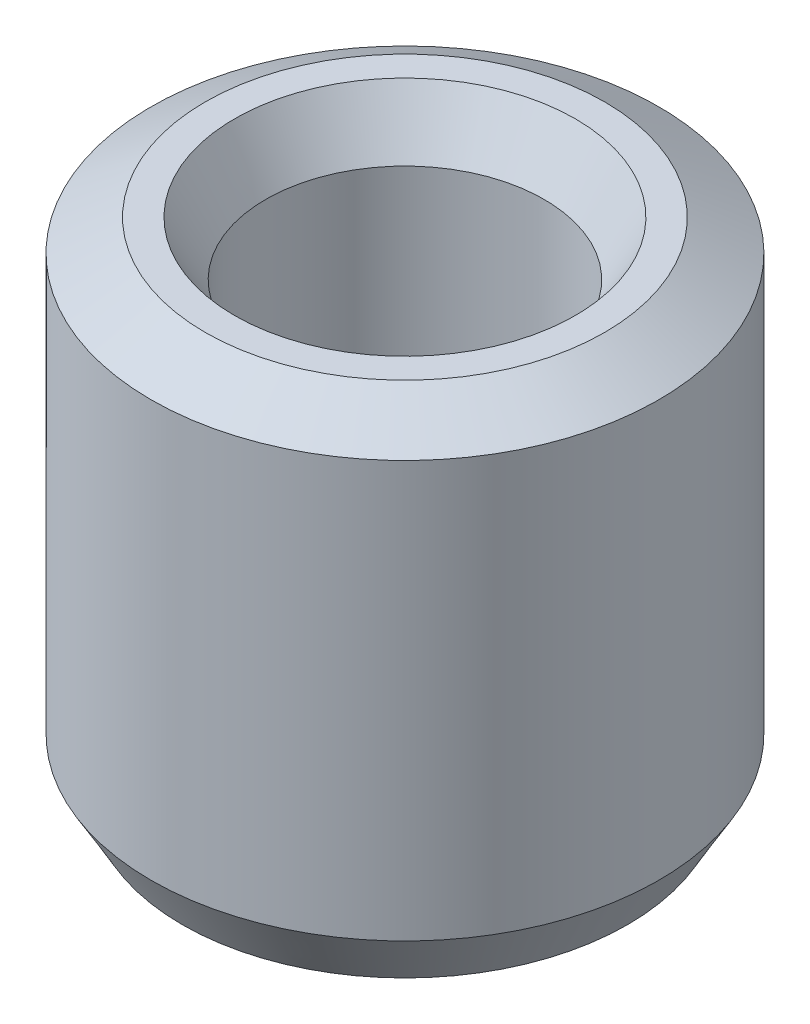
ISO-10303-21;
HEADER;
FILE_DESCRIPTION(('STEP AP214'),'2;1');
FILE_NAME('part.step','',(''),(''),'','','');
FILE_SCHEMA(('AUTOMOTIVE_DESIGN { 1 0 10303 214 1 1 1 1 }'));
ENDSEC;
DATA;
#1=APPLICATION_CONTEXT('core data for automotive mechanical design processes');
#2=APPLICATION_PROTOCOL_DEFINITION('international standard','automotive_design',2000,#1);
#3=PRODUCT_CONTEXT('',#1,'mechanical');
#4=PRODUCT('Part','Part','',(#3));
#5=PRODUCT_RELATED_PRODUCT_CATEGORY('part','',(#4));
#6=PRODUCT_DEFINITION_FORMATION('','',#4);
#7=PRODUCT_DEFINITION_CONTEXT('part definition',#1,'design');
#8=PRODUCT_DEFINITION('design','',#6,#7);
#9=PRODUCT_DEFINITION_SHAPE('','',#8);
#10=(LENGTH_UNIT() NAMED_UNIT(*) SI_UNIT(.MILLI.,.METRE.));
#11=(NAMED_UNIT(*) PLANE_ANGLE_UNIT() SI_UNIT($,.RADIAN.));
#12=(NAMED_UNIT(*) SI_UNIT($,.STERADIAN.) SOLID_ANGLE_UNIT());
#13=UNCERTAINTY_MEASURE_WITH_UNIT(LENGTH_MEASURE(1.E-05),#10,'distance_accuracy_value','');
#14=(GEOMETRIC_REPRESENTATION_CONTEXT(3) GLOBAL_UNCERTAINTY_ASSIGNED_CONTEXT((#13)) GLOBAL_UNIT_ASSIGNED_CONTEXT((#10,
#11,#12)) REPRESENTATION_CONTEXT('',''));
#15=CARTESIAN_POINT('',(0.,0.,0.));
#16=DIRECTION('',(0.,0.,1.));
#17=DIRECTION('',(1.,0.,0.));
#18=AXIS2_PLACEMENT_3D('',#15,#16,#17);
#19=CARTESIAN_POINT('',(0.,24.6970537670291,0.));
#20=DIRECTION('',(0.,-1.,0.));
#21=DIRECTION('',(0.,0.,-1.));
#22=AXIS2_PLACEMENT_3D('',#19,#20,#21);
#23=CYLINDRICAL_SURFACE('',#22,12.5);
#24=CARTESIAN_POINT('',(0.,2.66538334737681,0.));
#25=DIRECTION('',(0.,1.,0.));
#26=DIRECTION('',(0.,0.,1.));
#27=AXIS2_PLACEMENT_3D('',#24,#25,#26);
#28=CIRCLE('',#27,12.5);
#29=CARTESIAN_POINT('',(0.,2.66538334737681,12.5));
#30=VERTEX_POINT('',#29);
#31=EDGE_CURVE('E10',#30,#30,#28,.T.);
#32=ORIENTED_EDGE('',*,*,#31,.T.);
#33=EDGE_LOOP('',(#32));
#34=FACE_BOUND('',#33,.T.);
#35=CARTESIAN_POINT('',(0.,23.1581939739276,0.));
#36=DIRECTION('',(0.,1.,0.));
#37=DIRECTION('',(0.,0.,1.));
#38=AXIS2_PLACEMENT_3D('',#35,#36,#37);
#39=CIRCLE('',#38,12.5);
#40=CARTESIAN_POINT('',(0.,23.1581939739276,12.5));
#41=VERTEX_POINT('',#40);
#42=EDGE_CURVE('E50',#41,#41,#39,.F.);
#43=ORIENTED_EDGE('',*,*,#42,.T.);
#44=EDGE_LOOP('',(#43));
#45=FACE_BOUND('',#44,.T.);
#46=ADVANCED_FACE('F39',(#34,#45),#23,.T.);
#47=CARTESIAN_POINT('',(0.,24.6970537670291,0.));
#48=DIRECTION('',(0.,1.,0.));
#49=DIRECTION('',(0.,0.,1.));
#50=AXIS2_PLACEMENT_3D('',#47,#48,#49);
#51=PLANE('',#50);
#52=CARTESIAN_POINT('',(0.,24.6970537670291,0.));
#53=DIRECTION('',(0.,1.,0.));
#54=DIRECTION('',(0.,0.,1.));
#55=AXIS2_PLACEMENT_3D('',#52,#53,#54);
#56=CIRCLE('',#55,8.3917706725612);
#57=CARTESIAN_POINT('',(0.,24.6970537670291,8.3917706725612));
#58=VERTEX_POINT('',#57);
#59=EDGE_CURVE('E58',#58,#58,#56,.F.);
#60=ORIENTED_EDGE('',*,*,#59,.T.);
#61=EDGE_LOOP('',(#60));
#62=FACE_BOUND('',#61,.T.);
#63=CARTESIAN_POINT('',(0.,24.6970537670291,0.));
#64=DIRECTION('',(0.,1.,0.));
#65=DIRECTION('',(0.,0.,1.));
#66=AXIS2_PLACEMENT_3D('',#63,#64,#65);
#67=CIRCLE('',#66,9.8346166526232);
#68=CARTESIAN_POINT('',(0.,24.6970537670291,9.8346166526232));
#69=VERTEX_POINT('',#68);
#70=EDGE_CURVE('E61',#69,#69,#67,.T.);
#71=ORIENTED_EDGE('',*,*,#70,.T.);
#72=EDGE_LOOP('',(#71));
#73=FACE_BOUND('',#72,.T.);
#74=ADVANCED_FACE('F88',(#62,#73),#51,.T.);
#75=CARTESIAN_POINT('',(0.,0.,0.));
#76=DIRECTION('',(0.,1.,0.));
#77=DIRECTION('',(0.,0.,1.));
#78=AXIS2_PLACEMENT_3D('',#75,#76,#77);
#79=PLANE('',#78);
#80=CARTESIAN_POINT('',(0.,0.,0.));
#81=DIRECTION('',(0.,1.,0.));
#82=DIRECTION('',(0.,0.,1.));
#83=AXIS2_PLACEMENT_3D('',#80,#81,#82);
#84=CIRCLE('',#83,9.51829422683645);
#85=CARTESIAN_POINT('',(0.,0.,9.51829422683645));
#86=VERTEX_POINT('',#85);
#87=EDGE_CURVE('E51',#86,#86,#84,.T.);
#88=ORIENTED_EDGE('',*,*,#87,.T.);
#89=EDGE_LOOP('',(#88));
#90=FACE_BOUND('',#89,.T.);
#91=CARTESIAN_POINT('',(0.,0.,0.));
#92=DIRECTION('',(0.,1.,0.));
#93=DIRECTION('',(0.,0.,1.));
#94=AXIS2_PLACEMENT_3D('',#91,#92,#93);
#95=CIRCLE('',#94,10.9611402068984);
#96=CARTESIAN_POINT('',(0.,0.,10.9611402068984));
#97=VERTEX_POINT('',#96);
#98=EDGE_CURVE('E54',#97,#97,#95,.F.);
#99=ORIENTED_EDGE('',*,*,#98,.T.);
#100=EDGE_LOOP('',(#99));
#101=FACE_BOUND('',#100,.T.);
#102=ADVANCED_FACE('F83',(#90,#101),#79,.F.);
#103=CARTESIAN_POINT('',(0.,24.6970537670291,0.));
#104=DIRECTION('',(0.,-1.,0.));
#105=DIRECTION('',(0.,0.,-1.));
#106=AXIS2_PLACEMENT_3D('',#103,#104,#105);
#107=CYLINDRICAL_SURFACE('',#106,6.85291087945964);
#108=CARTESIAN_POINT('',(0.,22.0316704196523,0.));
#109=DIRECTION('',(0.,1.,0.));
#110=DIRECTION('',(0.,0.,1.));
#111=AXIS2_PLACEMENT_3D('',#108,#109,#110);
#112=CIRCLE('',#111,6.85291087945964);
#113=CARTESIAN_POINT('',(0.,22.0316704196523,6.85291087945964));
#114=VERTEX_POINT('',#113);
#115=EDGE_CURVE('E67',#114,#114,#112,.T.);
#116=ORIENTED_EDGE('',*,*,#115,.T.);
#117=EDGE_LOOP('',(#116));
#118=FACE_BOUND('',#117,.T.);
#119=CARTESIAN_POINT('',(0.,1.53885979310156,0.));
#120=DIRECTION('',(0.,1.,0.));
#121=DIRECTION('',(0.,0.,1.));
#122=AXIS2_PLACEMENT_3D('',#119,#120,#121);
#123=CIRCLE('',#122,6.85291087945964);
#124=CARTESIAN_POINT('',(0.,1.53885979310156,6.85291087945964));
#125=VERTEX_POINT('',#124);
#126=EDGE_CURVE('E69',#125,#125,#123,.F.);
#127=ORIENTED_EDGE('',*,*,#126,.T.);
#128=EDGE_LOOP('',(#127));
#129=FACE_BOUND('',#128,.T.);
#130=ADVANCED_FACE('F71',(#118,#129),#107,.F.);
#131=CARTESIAN_POINT('',(0.,22.0316704196523,0.));
#132=DIRECTION('',(0.,1.,0.));
#133=DIRECTION('',(0.,0.,1.));
#134=AXIS2_PLACEMENT_3D('',#131,#132,#133);
#135=CONICAL_SURFACE('',#134,6.85291087945964,0.523598775598303);
#136=ORIENTED_EDGE('',*,*,#59,.F.);
#137=EDGE_LOOP('',(#136));
#138=FACE_BOUND('',#137,.T.);
#139=ORIENTED_EDGE('',*,*,#115,.F.);
#140=EDGE_LOOP('',(#139));
#141=FACE_BOUND('',#140,.T.);
#142=ADVANCED_FACE('F77',(#138,#141),#135,.F.);
#143=CARTESIAN_POINT('',(0.,0.,0.));
#144=DIRECTION('',(0.,-1.,0.));
#145=DIRECTION('',(0.,0.,-1.));
#146=AXIS2_PLACEMENT_3D('',#143,#144,#145);
#147=CONICAL_SURFACE('',#146,9.51829422683645,1.04719755119659);
#148=ORIENTED_EDGE('',*,*,#126,.F.);
#149=EDGE_LOOP('',(#148));
#150=FACE_BOUND('',#149,.T.);
#151=ORIENTED_EDGE('',*,*,#87,.F.);
#152=EDGE_LOOP('',(#151));
#153=FACE_BOUND('',#152,.T.);
#154=ADVANCED_FACE('F73',(#150,#153),#147,.F.);
#155=CARTESIAN_POINT('',(0.,2.66538334737681,0.));
#156=DIRECTION('',(0.,1.,0.));
#157=DIRECTION('',(0.,0.,1.));
#158=AXIS2_PLACEMENT_3D('',#155,#156,#157);
#159=CONICAL_SURFACE('',#158,12.5,0.523598775598303);
#160=ORIENTED_EDGE('',*,*,#98,.F.);
#161=EDGE_LOOP('',(#160));
#162=FACE_BOUND('',#161,.T.);
#163=ORIENTED_EDGE('',*,*,#31,.F.);
#164=EDGE_LOOP('',(#163));
#165=FACE_BOUND('',#164,.T.);
#166=ADVANCED_FACE('F76',(#162,#165),#159,.T.);
#167=CARTESIAN_POINT('',(0.,24.6970537670291,0.));
#168=DIRECTION('',(0.,-1.,0.));
#169=DIRECTION('',(0.,0.,-1.));
#170=AXIS2_PLACEMENT_3D('',#167,#168,#169);
#171=CONICAL_SURFACE('',#170,9.8346166526232,1.04719755119659);
#172=ORIENTED_EDGE('',*,*,#42,.F.);
#173=EDGE_LOOP('',(#172));
#174=FACE_BOUND('',#173,.T.);
#175=ORIENTED_EDGE('',*,*,#70,.F.);
#176=EDGE_LOOP('',(#175));
#177=FACE_BOUND('',#176,.T.);
#178=ADVANCED_FACE('F45',(#174,#177),#171,.T.);
#179=CLOSED_SHELL('',(#46,#74,#102,#130,#142,#154,#166,#178));
#180=MANIFOLD_SOLID_BREP('B2',#179);
#181=ADVANCED_BREP_SHAPE_REPRESENTATION('',(#18,#180),#14);
#182=SHAPE_DEFINITION_REPRESENTATION(#9,#181);
ENDSEC;
END-ISO-10303-21;
